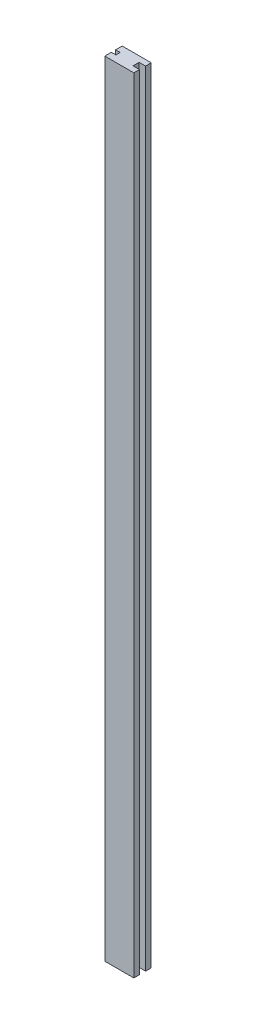
ISO-10303-21;
HEADER;
FILE_DESCRIPTION(('STEP AP214'),'2;1');
FILE_NAME('part.step','',(''),(''),'','','');
FILE_SCHEMA(('AUTOMOTIVE_DESIGN { 1 0 10303 214 1 1 1 1 }'));
ENDSEC;
DATA;
#1=APPLICATION_CONTEXT('core data for automotive mechanical design processes');
#2=APPLICATION_PROTOCOL_DEFINITION('international standard','automotive_design',2000,#1);
#3=PRODUCT_CONTEXT('',#1,'mechanical');
#4=PRODUCT('Part','Part','',(#3));
#5=PRODUCT_RELATED_PRODUCT_CATEGORY('part','',(#4));
#6=PRODUCT_DEFINITION_FORMATION('','',#4);
#7=PRODUCT_DEFINITION_CONTEXT('part definition',#1,'design');
#8=PRODUCT_DEFINITION('design','',#6,#7);
#9=PRODUCT_DEFINITION_SHAPE('','',#8);
#10=(LENGTH_UNIT() NAMED_UNIT(*) SI_UNIT(.MILLI.,.METRE.));
#11=(NAMED_UNIT(*) PLANE_ANGLE_UNIT() SI_UNIT($,.RADIAN.));
#12=(NAMED_UNIT(*) SI_UNIT($,.STERADIAN.) SOLID_ANGLE_UNIT());
#13=UNCERTAINTY_MEASURE_WITH_UNIT(LENGTH_MEASURE(1.E-05),#10,'distance_accuracy_value','');
#14=(GEOMETRIC_REPRESENTATION_CONTEXT(3) GLOBAL_UNCERTAINTY_ASSIGNED_CONTEXT((#13)) GLOBAL_UNIT_ASSIGNED_CONTEXT((#10,
#11,#12)) REPRESENTATION_CONTEXT('',''));
#15=CARTESIAN_POINT('',(0.,0.,0.));
#16=DIRECTION('',(0.,0.,1.));
#17=DIRECTION('',(1.,0.,0.));
#18=AXIS2_PLACEMENT_3D('',#15,#16,#17);
#19=CARTESIAN_POINT('',(0.,1350.,3.65766365544055));
#20=DIRECTION('',(0.,0.,1.));
#21=DIRECTION('',(1.,0.,0.));
#22=AXIS2_PLACEMENT_3D('',#19,#20,#21);
#23=PLANE('',#22);
#24=DIRECTION('',(-1.,0.,0.));
#25=VECTOR('',#24,1.);
#26=CARTESIAN_POINT('',(0.,0.,3.65766365544055));
#27=LINE('',#26,#25);
#28=CARTESIAN_POINT('',(0.,0.,3.65766365544055));
#29=VERTEX_POINT('',#28);
#30=CARTESIAN_POINT('',(-7.95699117528598,0.,3.65766365544056));
#31=VERTEX_POINT('',#30);
#32=EDGE_CURVE('E153',#29,#31,#27,.T.);
#33=ORIENTED_EDGE('',*,*,#32,.T.);
#34=DIRECTION('',(0.,-1.,0.));
#35=VECTOR('',#34,1.);
#36=CARTESIAN_POINT('',(-7.95699117528598,1350.,3.65766365544056));
#37=LINE('',#36,#35);
#38=CARTESIAN_POINT('',(-7.95699117528598,1350.,3.65766365544056));
#39=VERTEX_POINT('',#38);
#40=EDGE_CURVE('E11',#39,#31,#37,.T.);
#41=ORIENTED_EDGE('',*,*,#40,.F.);
#42=DIRECTION('',(-1.,0.,0.));
#43=VECTOR('',#42,1.);
#44=CARTESIAN_POINT('',(0.,1350.,3.65766365544055));
#45=LINE('',#44,#43);
#46=CARTESIAN_POINT('',(0.,1350.,3.65766365544055));
#47=VERTEX_POINT('',#46);
#48=EDGE_CURVE('E176',#47,#39,#45,.T.);
#49=ORIENTED_EDGE('',*,*,#48,.F.);
#50=DIRECTION('',(0.,-1.,0.));
#51=VECTOR('',#50,1.);
#52=CARTESIAN_POINT('',(0.,1350.,3.65766365544055));
#53=LINE('',#52,#51);
#54=EDGE_CURVE('E149',#47,#29,#53,.T.);
#55=ORIENTED_EDGE('',*,*,#54,.T.);
#56=EDGE_LOOP('',(#33,#41,#49,#55));
#57=FACE_BOUND('',#56,.T.);
#58=ADVANCED_FACE('F33',(#57),#23,.F.);
#59=CARTESIAN_POINT('',(-7.95699117528598,1350.,3.65766365544056));
#60=DIRECTION('',(1.,0.,0.));
#61=DIRECTION('',(0.,0.,-1.));
#62=AXIS2_PLACEMENT_3D('',#59,#60,#61);
#63=PLANE('',#62);
#64=DIRECTION('',(0.,0.,1.));
#65=VECTOR('',#64,1.);
#66=CARTESIAN_POINT('',(-7.95699117528598,0.,3.65766365544056));
#67=LINE('',#66,#65);
#68=CARTESIAN_POINT('',(-7.95699117528598,0.,15.));
#69=VERTEX_POINT('',#68);
#70=EDGE_CURVE('E156',#31,#69,#67,.T.);
#71=ORIENTED_EDGE('',*,*,#70,.T.);
#72=DIRECTION('',(0.,-1.,0.));
#73=VECTOR('',#72,1.);
#74=CARTESIAN_POINT('',(-7.95699117528598,1350.,15.));
#75=LINE('',#74,#73);
#76=CARTESIAN_POINT('',(-7.95699117528598,1350.,15.));
#77=VERTEX_POINT('',#76);
#78=EDGE_CURVE('E41',#77,#69,#75,.T.);
#79=ORIENTED_EDGE('',*,*,#78,.F.);
#80=DIRECTION('',(0.,0.,1.));
#81=VECTOR('',#80,1.);
#82=CARTESIAN_POINT('',(-7.95699117528598,1350.,3.65766365544056));
#83=LINE('',#82,#81);
#84=EDGE_CURVE('E104',#39,#77,#83,.T.);
#85=ORIENTED_EDGE('',*,*,#84,.F.);
#86=ORIENTED_EDGE('',*,*,#40,.T.);
#87=EDGE_LOOP('',(#71,#79,#85,#86));
#88=FACE_BOUND('',#87,.T.);
#89=ADVANCED_FACE('F253',(#88),#63,.F.);
#90=CARTESIAN_POINT('',(-7.95699117528598,1350.,15.));
#91=DIRECTION('',(0.,0.,-1.));
#92=DIRECTION('',(-1.,0.,0.));
#93=AXIS2_PLACEMENT_3D('',#90,#91,#92);
#94=PLANE('',#93);
#95=DIRECTION('',(1.,0.,0.));
#96=VECTOR('',#95,1.);
#97=CARTESIAN_POINT('',(-7.95699117528598,0.,15.));
#98=LINE('',#97,#96);
#99=CARTESIAN_POINT('',(42.043008824714,0.,15.));
#100=VERTEX_POINT('',#99);
#101=EDGE_CURVE('E158',#69,#100,#98,.T.);
#102=ORIENTED_EDGE('',*,*,#101,.T.);
#103=DIRECTION('',(0.,-1.,0.));
#104=VECTOR('',#103,1.);
#105=CARTESIAN_POINT('',(42.043008824714,1350.,15.));
#106=LINE('',#105,#104);
#107=CARTESIAN_POINT('',(42.043008824714,1350.,15.));
#108=VERTEX_POINT('',#107);
#109=EDGE_CURVE('E195',#108,#100,#106,.T.);
#110=ORIENTED_EDGE('',*,*,#109,.F.);
#111=DIRECTION('',(1.,0.,0.));
#112=VECTOR('',#111,1.);
#113=CARTESIAN_POINT('',(-7.95699117528598,1350.,15.));
#114=LINE('',#113,#112);
#115=EDGE_CURVE('E203',#77,#108,#114,.T.);
#116=ORIENTED_EDGE('',*,*,#115,.F.);
#117=ORIENTED_EDGE('',*,*,#78,.T.);
#118=EDGE_LOOP('',(#102,#110,#116,#117));
#119=FACE_BOUND('',#118,.T.);
#120=ADVANCED_FACE('F201',(#119),#94,.F.);
#121=CARTESIAN_POINT('',(42.043008824714,1350.,15.));
#122=DIRECTION('',(-1.,0.,0.));
#123=DIRECTION('',(0.,0.,1.));
#124=AXIS2_PLACEMENT_3D('',#121,#122,#123);
#125=PLANE('',#124);
#126=DIRECTION('',(0.,0.,-1.));
#127=VECTOR('',#126,1.);
#128=CARTESIAN_POINT('',(42.043008824714,0.,15.));
#129=LINE('',#128,#127);
#130=CARTESIAN_POINT('',(42.043008824714,0.,5.25));
#131=VERTEX_POINT('',#130);
#132=EDGE_CURVE('E160',#100,#131,#129,.T.);
#133=ORIENTED_EDGE('',*,*,#132,.T.);
#134=DIRECTION('',(0.,-1.,0.));
#135=VECTOR('',#134,1.);
#136=CARTESIAN_POINT('',(42.043008824714,1350.,5.25));
#137=LINE('',#136,#135);
#138=CARTESIAN_POINT('',(42.043008824714,1350.,5.25));
#139=VERTEX_POINT('',#138);
#140=EDGE_CURVE('E192',#139,#131,#137,.T.);
#141=ORIENTED_EDGE('',*,*,#140,.F.);
#142=DIRECTION('',(0.,0.,-1.));
#143=VECTOR('',#142,1.);
#144=CARTESIAN_POINT('',(42.043008824714,1350.,15.));
#145=LINE('',#144,#143);
#146=EDGE_CURVE('E220',#108,#139,#145,.T.);
#147=ORIENTED_EDGE('',*,*,#146,.F.);
#148=ORIENTED_EDGE('',*,*,#109,.T.);
#149=EDGE_LOOP('',(#133,#141,#147,#148));
#150=FACE_BOUND('',#149,.T.);
#151=ADVANCED_FACE('F211',(#150),#125,.F.);
#152=CARTESIAN_POINT('',(42.043008824714,1350.,5.25));
#153=DIRECTION('',(0.,0.,1.));
#154=DIRECTION('',(1.,0.,0.));
#155=AXIS2_PLACEMENT_3D('',#152,#153,#154);
#156=PLANE('',#155);
#157=DIRECTION('',(-1.,0.,0.));
#158=VECTOR('',#157,1.);
#159=CARTESIAN_POINT('',(42.043008824714,0.,5.25));
#160=LINE('',#159,#158);
#161=CARTESIAN_POINT('',(31.,0.,5.25));
#162=VERTEX_POINT('',#161);
#163=EDGE_CURVE('E162',#131,#162,#160,.T.);
#164=ORIENTED_EDGE('',*,*,#163,.T.);
#165=DIRECTION('',(0.,-1.,0.));
#166=VECTOR('',#165,1.);
#167=CARTESIAN_POINT('',(31.,1350.,5.25));
#168=LINE('',#167,#166);
#169=CARTESIAN_POINT('',(31.,1350.,5.25));
#170=VERTEX_POINT('',#169);
#171=EDGE_CURVE('E189',#170,#162,#168,.T.);
#172=ORIENTED_EDGE('',*,*,#171,.F.);
#173=DIRECTION('',(-1.,0.,0.));
#174=VECTOR('',#173,1.);
#175=CARTESIAN_POINT('',(42.043008824714,1350.,5.25));
#176=LINE('',#175,#174);
#177=EDGE_CURVE('E217',#139,#170,#176,.T.);
#178=ORIENTED_EDGE('',*,*,#177,.F.);
#179=ORIENTED_EDGE('',*,*,#140,.T.);
#180=EDGE_LOOP('',(#164,#172,#178,#179));
#181=FACE_BOUND('',#180,.T.);
#182=ADVANCED_FACE('F215',(#181),#156,.F.);
#183=CARTESIAN_POINT('',(31.,1350.,-5.25));
#184=DIRECTION('',(-1.,0.,0.));
#185=DIRECTION('',(0.,0.,1.));
#186=AXIS2_PLACEMENT_3D('',#183,#184,#185);
#187=PLANE('',#186);
#188=DIRECTION('',(0.,0.,-1.));
#189=VECTOR('',#188,1.);
#190=CARTESIAN_POINT('',(31.,0.,-5.25));
#191=LINE('',#190,#189);
#192=CARTESIAN_POINT('',(31.,0.,-5.25));
#193=VERTEX_POINT('',#192);
#194=EDGE_CURVE('E165',#162,#193,#191,.T.);
#195=ORIENTED_EDGE('',*,*,#194,.T.);
#196=DIRECTION('',(0.,-1.,0.));
#197=VECTOR('',#196,1.);
#198=CARTESIAN_POINT('',(31.,1350.,-5.25));
#199=LINE('',#198,#197);
#200=CARTESIAN_POINT('',(31.,1350.,-5.25));
#201=VERTEX_POINT('',#200);
#202=EDGE_CURVE('E186',#201,#193,#199,.T.);
#203=ORIENTED_EDGE('',*,*,#202,.F.);
#204=DIRECTION('',(0.,0.,-1.));
#205=VECTOR('',#204,1.);
#206=CARTESIAN_POINT('',(31.,1350.,5.25));
#207=LINE('',#206,#205);
#208=EDGE_CURVE('E219',#170,#201,#207,.T.);
#209=ORIENTED_EDGE('',*,*,#208,.F.);
#210=ORIENTED_EDGE('',*,*,#171,.T.);
#211=EDGE_LOOP('',(#195,#203,#209,#210));
#212=FACE_BOUND('',#211,.T.);
#213=ADVANCED_FACE('F266',(#212),#187,.F.);
#214=CARTESIAN_POINT('',(42.043008824714,1350.,-5.25));
#215=DIRECTION('',(0.,0.,-1.));
#216=DIRECTION('',(-1.,0.,0.));
#217=AXIS2_PLACEMENT_3D('',#214,#215,#216);
#218=PLANE('',#217);
#219=DIRECTION('',(1.,0.,0.));
#220=VECTOR('',#219,1.);
#221=CARTESIAN_POINT('',(42.043008824714,0.,-5.25));
#222=LINE('',#221,#220);
#223=CARTESIAN_POINT('',(42.043008824714,0.,-5.25));
#224=VERTEX_POINT('',#223);
#225=EDGE_CURVE('E167',#193,#224,#222,.T.);
#226=ORIENTED_EDGE('',*,*,#225,.T.);
#227=DIRECTION('',(0.,-1.,0.));
#228=VECTOR('',#227,1.);
#229=CARTESIAN_POINT('',(42.043008824714,1350.,-5.25));
#230=LINE('',#229,#228);
#231=CARTESIAN_POINT('',(42.043008824714,1350.,-5.25));
#232=VERTEX_POINT('',#231);
#233=EDGE_CURVE('E183',#232,#224,#230,.T.);
#234=ORIENTED_EDGE('',*,*,#233,.F.);
#235=DIRECTION('',(1.,0.,0.));
#236=VECTOR('',#235,1.);
#237=CARTESIAN_POINT('',(42.043008824714,1350.,-5.25));
#238=LINE('',#237,#236);
#239=EDGE_CURVE('E222',#201,#232,#238,.T.);
#240=ORIENTED_EDGE('',*,*,#239,.F.);
#241=ORIENTED_EDGE('',*,*,#202,.T.);
#242=EDGE_LOOP('',(#226,#234,#240,#241));
#243=FACE_BOUND('',#242,.T.);
#244=ADVANCED_FACE('F269',(#243),#218,.F.);
#245=CARTESIAN_POINT('',(42.043008824714,1350.,-15.));
#246=DIRECTION('',(-1.,0.,0.));
#247=DIRECTION('',(0.,0.,1.));
#248=AXIS2_PLACEMENT_3D('',#245,#246,#247);
#249=PLANE('',#248);
#250=DIRECTION('',(0.,0.,-1.));
#251=VECTOR('',#250,1.);
#252=CARTESIAN_POINT('',(42.043008824714,0.,-15.));
#253=LINE('',#252,#251);
#254=CARTESIAN_POINT('',(42.043008824714,0.,-15.));
#255=VERTEX_POINT('',#254);
#256=EDGE_CURVE('E169',#224,#255,#253,.T.);
#257=ORIENTED_EDGE('',*,*,#256,.T.);
#258=DIRECTION('',(0.,-1.,0.));
#259=VECTOR('',#258,1.);
#260=CARTESIAN_POINT('',(42.043008824714,1350.,-15.));
#261=LINE('',#260,#259);
#262=CARTESIAN_POINT('',(42.043008824714,1350.,-15.));
#263=VERTEX_POINT('',#262);
#264=EDGE_CURVE('E180',#263,#255,#261,.T.);
#265=ORIENTED_EDGE('',*,*,#264,.F.);
#266=DIRECTION('',(0.,0.,-1.));
#267=VECTOR('',#266,1.);
#268=CARTESIAN_POINT('',(42.043008824714,1350.,-15.));
#269=LINE('',#268,#267);
#270=EDGE_CURVE('E228',#232,#263,#269,.T.);
#271=ORIENTED_EDGE('',*,*,#270,.F.);
#272=ORIENTED_EDGE('',*,*,#233,.T.);
#273=EDGE_LOOP('',(#257,#265,#271,#272));
#274=FACE_BOUND('',#273,.T.);
#275=ADVANCED_FACE('F234',(#274),#249,.F.);
#276=CARTESIAN_POINT('',(-7.95699117528598,1350.,-15.));
#277=DIRECTION('',(0.,0.,1.));
#278=DIRECTION('',(1.,0.,0.));
#279=AXIS2_PLACEMENT_3D('',#276,#277,#278);
#280=PLANE('',#279);
#281=DIRECTION('',(-1.,0.,0.));
#282=VECTOR('',#281,1.);
#283=CARTESIAN_POINT('',(-7.95699117528598,0.,-15.));
#284=LINE('',#283,#282);
#285=CARTESIAN_POINT('',(-7.95699117528598,0.,-15.));
#286=VERTEX_POINT('',#285);
#287=EDGE_CURVE('E171',#255,#286,#284,.T.);
#288=ORIENTED_EDGE('',*,*,#287,.T.);
#289=DIRECTION('',(0.,-1.,0.));
#290=VECTOR('',#289,1.);
#291=CARTESIAN_POINT('',(-7.95699117528598,1350.,-15.));
#292=LINE('',#291,#290);
#293=CARTESIAN_POINT('',(-7.95699117528598,1350.,-15.));
#294=VERTEX_POINT('',#293);
#295=EDGE_CURVE('E144',#294,#286,#292,.T.);
#296=ORIENTED_EDGE('',*,*,#295,.F.);
#297=DIRECTION('',(-1.,0.,0.));
#298=VECTOR('',#297,1.);
#299=CARTESIAN_POINT('',(-7.95699117528598,1350.,-15.));
#300=LINE('',#299,#298);
#301=EDGE_CURVE('E135',#263,#294,#300,.T.);
#302=ORIENTED_EDGE('',*,*,#301,.F.);
#303=ORIENTED_EDGE('',*,*,#264,.T.);
#304=EDGE_LOOP('',(#288,#296,#302,#303));
#305=FACE_BOUND('',#304,.T.);
#306=ADVANCED_FACE('F238',(#305),#280,.F.);
#307=CARTESIAN_POINT('',(-7.95699117528598,1350.,-3.65766365544056));
#308=DIRECTION('',(1.,0.,0.));
#309=DIRECTION('',(0.,0.,-1.));
#310=AXIS2_PLACEMENT_3D('',#307,#308,#309);
#311=PLANE('',#310);
#312=DIRECTION('',(0.,0.,1.));
#313=VECTOR('',#312,1.);
#314=CARTESIAN_POINT('',(-7.95699117528598,0.,-3.65766365544056));
#315=LINE('',#314,#313);
#316=CARTESIAN_POINT('',(-7.95699117528598,0.,-3.65766365544056));
#317=VERTEX_POINT('',#316);
#318=EDGE_CURVE('E143',#286,#317,#315,.T.);
#319=ORIENTED_EDGE('',*,*,#318,.T.);
#320=DIRECTION('',(0.,-1.,0.));
#321=VECTOR('',#320,1.);
#322=CARTESIAN_POINT('',(-7.95699117528598,1350.,-3.65766365544056));
#323=LINE('',#322,#321);
#324=CARTESIAN_POINT('',(-7.95699117528598,1350.,-3.65766365544056));
#325=VERTEX_POINT('',#324);
#326=EDGE_CURVE('E140',#325,#317,#323,.T.);
#327=ORIENTED_EDGE('',*,*,#326,.F.);
#328=DIRECTION('',(0.,0.,1.));
#329=VECTOR('',#328,1.);
#330=CARTESIAN_POINT('',(-7.95699117528598,1350.,-3.65766365544056));
#331=LINE('',#330,#329);
#332=EDGE_CURVE('E129',#294,#325,#331,.T.);
#333=ORIENTED_EDGE('',*,*,#332,.F.);
#334=ORIENTED_EDGE('',*,*,#295,.T.);
#335=EDGE_LOOP('',(#319,#327,#333,#334));
#336=FACE_BOUND('',#335,.T.);
#337=ADVANCED_FACE('F141',(#336),#311,.F.);
#338=CARTESIAN_POINT('',(0.,1350.,-3.65766365544055));
#339=DIRECTION('',(0.,0.,-1.));
#340=DIRECTION('',(-1.,0.,0.));
#341=AXIS2_PLACEMENT_3D('',#338,#339,#340);
#342=PLANE('',#341);
#343=DIRECTION('',(1.,0.,0.));
#344=VECTOR('',#343,1.);
#345=CARTESIAN_POINT('',(0.,0.,-3.65766365544055));
#346=LINE('',#345,#344);
#347=CARTESIAN_POINT('',(0.,0.,-3.65766365544055));
#348=VERTEX_POINT('',#347);
#349=EDGE_CURVE('E90',#317,#348,#346,.T.);
#350=ORIENTED_EDGE('',*,*,#349,.T.);
#351=DIRECTION('',(0.,-1.,0.));
#352=VECTOR('',#351,1.);
#353=CARTESIAN_POINT('',(0.,1350.,-3.65766365544055));
#354=LINE('',#353,#352);
#355=CARTESIAN_POINT('',(0.,1350.,-3.65766365544055));
#356=VERTEX_POINT('',#355);
#357=EDGE_CURVE('E145',#356,#348,#354,.T.);
#358=ORIENTED_EDGE('',*,*,#357,.F.);
#359=DIRECTION('',(1.,0.,0.));
#360=VECTOR('',#359,1.);
#361=CARTESIAN_POINT('',(0.,1350.,-3.65766365544055));
#362=LINE('',#361,#360);
#363=EDGE_CURVE('E133',#325,#356,#362,.T.);
#364=ORIENTED_EDGE('',*,*,#363,.F.);
#365=ORIENTED_EDGE('',*,*,#326,.T.);
#366=EDGE_LOOP('',(#350,#358,#364,#365));
#367=FACE_BOUND('',#366,.T.);
#368=ADVANCED_FACE('F147',(#367),#342,.F.);
#369=CARTESIAN_POINT('',(0.,1350.,-3.65766365544055));
#370=DIRECTION('',(1.,0.,0.));
#371=DIRECTION('',(0.,0.,-1.));
#372=AXIS2_PLACEMENT_3D('',#369,#370,#371);
#373=PLANE('',#372);
#374=DIRECTION('',(0.,0.,1.));
#375=VECTOR('',#374,1.);
#376=CARTESIAN_POINT('',(0.,0.,-3.65766365544055));
#377=LINE('',#376,#375);
#378=EDGE_CURVE('E96',#348,#29,#377,.T.);
#379=ORIENTED_EDGE('',*,*,#378,.T.);
#380=ORIENTED_EDGE('',*,*,#54,.F.);
#381=DIRECTION('',(0.,0.,1.));
#382=VECTOR('',#381,1.);
#383=CARTESIAN_POINT('',(0.,1350.,-3.65766365544055));
#384=LINE('',#383,#382);
#385=EDGE_CURVE('E49',#356,#47,#384,.T.);
#386=ORIENTED_EDGE('',*,*,#385,.F.);
#387=ORIENTED_EDGE('',*,*,#357,.T.);
#388=EDGE_LOOP('',(#379,#380,#386,#387));
#389=FACE_BOUND('',#388,.T.);
#390=ADVANCED_FACE('F242',(#389),#373,.F.);
#391=CARTESIAN_POINT('',(0.,1350.,0.));
#392=DIRECTION('',(0.,1.,0.));
#393=DIRECTION('',(0.,0.,1.));
#394=AXIS2_PLACEMENT_3D('',#391,#392,#393);
#395=PLANE('',#394);
#396=ORIENTED_EDGE('',*,*,#48,.T.);
#397=ORIENTED_EDGE('',*,*,#84,.T.);
#398=ORIENTED_EDGE('',*,*,#115,.T.);
#399=ORIENTED_EDGE('',*,*,#146,.T.);
#400=ORIENTED_EDGE('',*,*,#177,.T.);
#401=ORIENTED_EDGE('',*,*,#208,.T.);
#402=ORIENTED_EDGE('',*,*,#239,.T.);
#403=ORIENTED_EDGE('',*,*,#270,.T.);
#404=ORIENTED_EDGE('',*,*,#301,.T.);
#405=ORIENTED_EDGE('',*,*,#332,.T.);
#406=ORIENTED_EDGE('',*,*,#363,.T.);
#407=ORIENTED_EDGE('',*,*,#385,.T.);
#408=EDGE_LOOP('',(#396,#397,#398,#399,#400,#401,#402,#403,#404,#405,#406,#407));
#409=FACE_BOUND('',#408,.T.);
#410=ADVANCED_FACE('F131',(#409),#395,.T.);
#411=CARTESIAN_POINT('',(0.,0.,0.));
#412=DIRECTION('',(0.,1.,0.));
#413=DIRECTION('',(0.,0.,1.));
#414=AXIS2_PLACEMENT_3D('',#411,#412,#413);
#415=PLANE('',#414);
#416=ORIENTED_EDGE('',*,*,#32,.F.);
#417=ORIENTED_EDGE('',*,*,#378,.F.);
#418=ORIENTED_EDGE('',*,*,#349,.F.);
#419=ORIENTED_EDGE('',*,*,#318,.F.);
#420=ORIENTED_EDGE('',*,*,#287,.F.);
#421=ORIENTED_EDGE('',*,*,#256,.F.);
#422=ORIENTED_EDGE('',*,*,#225,.F.);
#423=ORIENTED_EDGE('',*,*,#194,.F.);
#424=ORIENTED_EDGE('',*,*,#163,.F.);
#425=ORIENTED_EDGE('',*,*,#132,.F.);
#426=ORIENTED_EDGE('',*,*,#101,.F.);
#427=ORIENTED_EDGE('',*,*,#70,.F.);
#428=EDGE_LOOP('',(#416,#417,#418,#419,#420,#421,#422,#423,#424,#425,#426,#427));
#429=FACE_BOUND('',#428,.T.);
#430=ADVANCED_FACE('F207',(#429),#415,.F.);
#431=CLOSED_SHELL('',(#58,#89,#120,#151,#182,#213,#244,#275,#306,#337,#368,#390,#410,#430));
#432=MANIFOLD_SOLID_BREP('B2',#431);
#433=ADVANCED_BREP_SHAPE_REPRESENTATION('',(#18,#432),#14);
#434=SHAPE_DEFINITION_REPRESENTATION(#9,#433);
ENDSEC;
END-ISO-10303-21;
